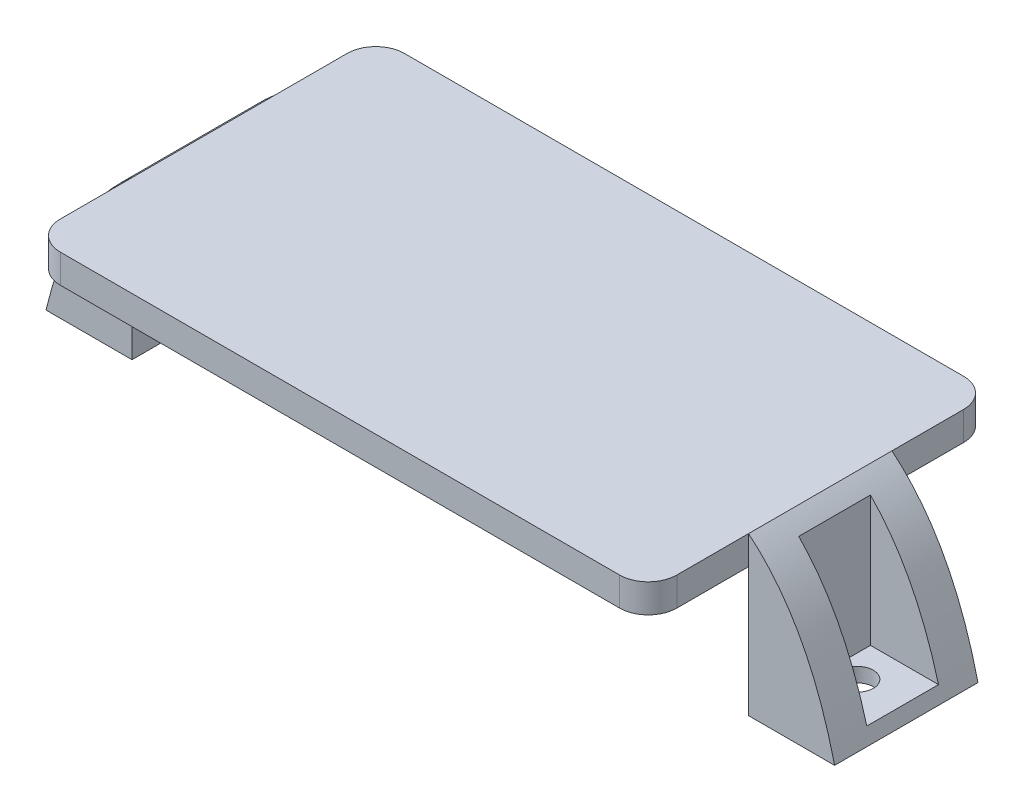
ISO-10303-21;
HEADER;
FILE_DESCRIPTION(('STEP AP214'),'2;1');
FILE_NAME('part.step','',(''),(''),'','','');
FILE_SCHEMA(('AUTOMOTIVE_DESIGN { 1 0 10303 214 1 1 1 1 }'));
ENDSEC;
DATA;
#1=APPLICATION_CONTEXT('core data for automotive mechanical design processes');
#2=APPLICATION_PROTOCOL_DEFINITION('international standard','automotive_design',2000,#1);
#3=PRODUCT_CONTEXT('',#1,'mechanical');
#4=PRODUCT('Part','Part','',(#3));
#5=PRODUCT_RELATED_PRODUCT_CATEGORY('part','',(#4));
#6=PRODUCT_DEFINITION_FORMATION('','',#4);
#7=PRODUCT_DEFINITION_CONTEXT('part definition',#1,'design');
#8=PRODUCT_DEFINITION('design','',#6,#7);
#9=PRODUCT_DEFINITION_SHAPE('','',#8);
#10=(LENGTH_UNIT() NAMED_UNIT(*) SI_UNIT(.MILLI.,.METRE.));
#11=(NAMED_UNIT(*) PLANE_ANGLE_UNIT() SI_UNIT($,.RADIAN.));
#12=(NAMED_UNIT(*) SI_UNIT($,.STERADIAN.) SOLID_ANGLE_UNIT());
#13=UNCERTAINTY_MEASURE_WITH_UNIT(LENGTH_MEASURE(1.E-05),#10,'distance_accuracy_value','');
#14=(GEOMETRIC_REPRESENTATION_CONTEXT(3) GLOBAL_UNCERTAINTY_ASSIGNED_CONTEXT((#13)) GLOBAL_UNIT_ASSIGNED_CONTEXT((#10,
#11,#12)) REPRESENTATION_CONTEXT('',''));
#15=CARTESIAN_POINT('',(0.,0.,0.));
#16=DIRECTION('',(0.,0.,1.));
#17=DIRECTION('',(1.,0.,0.));
#18=AXIS2_PLACEMENT_3D('',#15,#16,#17);
#19=CARTESIAN_POINT('',(-34.925,-13.97,-6.35));
#20=CARTESIAN_POINT('',(-28.7239984805834,11.9854693092136,-6.35));
#21=CARTESIAN_POINT('',(0.,0.,-6.35));
#22=B_SPLINE_CURVE_WITH_KNOTS('',2,(#19,#20,#21),.UNSPECIFIED.,.F.,.F.,(3,3),(0.,1.),.UNSPECIFIED.);
#23=DIRECTION('',(0.,0.,1.));
#24=VECTOR('',#23,1.);
#25=SURFACE_OF_LINEAR_EXTRUSION('',#22,#24);
#26=DIRECTION('',(0.,0.,1.));
#27=VECTOR('',#26,1.);
#28=CARTESIAN_POINT('',(-34.925,-13.97,-6.35));
#29=LINE('',#28,#27);
#30=CARTESIAN_POINT('',(-34.925,-13.97,-6.35));
#31=VERTEX_POINT('',#30);
#32=CARTESIAN_POINT('',(-34.925,-13.97,6.35));
#33=VERTEX_POINT('',#32);
#34=EDGE_CURVE('E243',#31,#33,#29,.T.);
#35=ORIENTED_EDGE('',*,*,#34,.T.);
#36=CARTESIAN_POINT('',(-34.925,-13.97,6.35));
#37=CARTESIAN_POINT('',(-28.7239984805834,11.9854693092136,6.35));
#38=CARTESIAN_POINT('',(0.,0.,6.35));
#39=B_SPLINE_CURVE_WITH_KNOTS('',2,(#36,#37,#38),.UNSPECIFIED.,.F.,.F.,(3,3),(0.,1.),.UNSPECIFIED.);
#40=CARTESIAN_POINT('',(-27.305,0.,6.35));
#41=VERTEX_POINT('',#40);
#42=EDGE_CURVE('E221',#33,#41,#39,.T.);
#43=ORIENTED_EDGE('',*,*,#42,.T.);
#44=DIRECTION('',(0.,0.,1.));
#45=VECTOR('',#44,1.);
#46=CARTESIAN_POINT('',(-27.305,0.,-6.35));
#47=LINE('',#46,#45);
#48=CARTESIAN_POINT('',(-27.305,0.,-6.34999999999999));
#49=VERTEX_POINT('',#48);
#50=EDGE_CURVE('E467',#49,#41,#47,.T.);
#51=ORIENTED_EDGE('',*,*,#50,.F.);
#52=EDGE_CURVE('E236',#31,#49,#22,.T.);
#53=ORIENTED_EDGE('',*,*,#52,.F.);
#54=EDGE_LOOP('',(#35,#43,#51,#53));
#55=FACE_BOUND('',#54,.T.);
#56=CARTESIAN_POINT('',(-34.925,-13.97,-3.175));
#57=CARTESIAN_POINT('',(-28.7239984805834,11.9854693092136,-3.175));
#58=CARTESIAN_POINT('',(0.,0.,-3.175));
#59=B_SPLINE_CURVE_WITH_KNOTS('',2,(#56,#57,#58),.UNSPECIFIED.,.F.,.F.,(3,3),(0.,1.),.UNSPECIFIED.);
#60=CARTESIAN_POINT('',(-28.575,-1.16685256923188,-3.175));
#61=VERTEX_POINT('',#60);
#62=CARTESIAN_POINT('',(-34.6019711182352,-12.7,-3.175));
#63=VERTEX_POINT('',#62);
#64=EDGE_CURVE('E11',#61,#63,#59,.F.);
#65=ORIENTED_EDGE('',*,*,#64,.F.);
#66=DIRECTION('',(0.,0.,1.));
#67=VECTOR('',#66,1.);
#68=CARTESIAN_POINT('',(-28.575,-1.16685256923188,-6.35));
#69=LINE('',#68,#67);
#70=CARTESIAN_POINT('',(-28.575,-1.16685256923593,3.175));
#71=VERTEX_POINT('',#70);
#72=EDGE_CURVE('E50',#71,#61,#69,.F.);
#73=ORIENTED_EDGE('',*,*,#72,.F.);
#74=CARTESIAN_POINT('',(-34.925,-13.97,3.175));
#75=CARTESIAN_POINT('',(-28.7239984805834,11.9854693092136,3.175));
#76=CARTESIAN_POINT('',(0.,0.,3.175));
#77=B_SPLINE_CURVE_WITH_KNOTS('',2,(#74,#75,#76),.UNSPECIFIED.,.F.,.F.,(3,3),(0.,1.),.UNSPECIFIED.);
#78=CARTESIAN_POINT('',(-34.6019711182352,-12.7,3.175));
#79=VERTEX_POINT('',#78);
#80=EDGE_CURVE('E204',#79,#71,#77,.T.);
#81=ORIENTED_EDGE('',*,*,#80,.F.);
#82=DIRECTION('',(0.,0.,1.));
#83=VECTOR('',#82,1.);
#84=CARTESIAN_POINT('',(-34.6019711182352,-12.7,-6.35));
#85=LINE('',#84,#83);
#86=EDGE_CURVE('E208',#63,#79,#85,.T.);
#87=ORIENTED_EDGE('',*,*,#86,.F.);
#88=EDGE_LOOP('',(#65,#73,#81,#87));
#89=FACE_BOUND('',#88,.T.);
#90=ADVANCED_FACE('F41',(#55,#89),#25,.F.);
#91=CARTESIAN_POINT('',(-27.305,-2.54,15.24));
#92=DIRECTION('',(-1.,0.,0.));
#93=DIRECTION('',(0.,0.,1.));
#94=AXIS2_PLACEMENT_3D('',#91,#92,#93);
#95=PLANE('',#94);
#96=DIRECTION('',(0.,0.,1.));
#97=VECTOR('',#96,1.);
#98=CARTESIAN_POINT('',(-27.305,0.,15.24));
#99=LINE('',#98,#97);
#100=CARTESIAN_POINT('',(-27.305,0.,12.7));
#101=VERTEX_POINT('',#100);
#102=EDGE_CURVE('E348',#41,#101,#99,.T.);
#103=ORIENTED_EDGE('',*,*,#102,.F.);
#104=DIRECTION('',(0.,-1.,0.));
#105=VECTOR('',#104,1.);
#106=CARTESIAN_POINT('',(-27.305,0.,6.35));
#107=LINE('',#106,#105);
#108=CARTESIAN_POINT('',(-27.305,-2.54,6.35));
#109=VERTEX_POINT('',#108);
#110=EDGE_CURVE('E64',#41,#109,#107,.T.);
#111=ORIENTED_EDGE('',*,*,#110,.T.);
#112=DIRECTION('',(0.,0.,1.));
#113=VECTOR('',#112,1.);
#114=CARTESIAN_POINT('',(-27.305,-2.54,15.24));
#115=LINE('',#114,#113);
#116=CARTESIAN_POINT('',(-27.305,-2.54,12.7));
#117=VERTEX_POINT('',#116);
#118=EDGE_CURVE('E334',#109,#117,#115,.T.);
#119=ORIENTED_EDGE('',*,*,#118,.T.);
#120=DIRECTION('',(0.,1.,0.));
#121=VECTOR('',#120,1.);
#122=CARTESIAN_POINT('',(-27.305,-2.54,12.7));
#123=LINE('',#122,#121);
#124=EDGE_CURVE('E367',#117,#101,#123,.T.);
#125=ORIENTED_EDGE('',*,*,#124,.T.);
#126=EDGE_LOOP('',(#103,#111,#119,#125));
#127=FACE_BOUND('',#126,.T.);
#128=ADVANCED_FACE('F252',(#127),#95,.T.);
#129=CARTESIAN_POINT('',(27.305,-2.54,15.24));
#130=DIRECTION('',(1.,0.,0.));
#131=DIRECTION('',(0.,0.,-1.));
#132=AXIS2_PLACEMENT_3D('',#129,#130,#131);
#133=PLANE('',#132);
#134=DIRECTION('',(0.,0.,-1.));
#135=VECTOR('',#134,1.);
#136=CARTESIAN_POINT('',(27.305,0.,15.24));
#137=LINE('',#136,#135);
#138=CARTESIAN_POINT('',(27.305,0.,-6.35));
#139=VERTEX_POINT('',#138);
#140=CARTESIAN_POINT('',(27.305,0.,-12.7));
#141=VERTEX_POINT('',#140);
#142=EDGE_CURVE('E322',#139,#141,#137,.T.);
#143=ORIENTED_EDGE('',*,*,#142,.F.);
#144=DIRECTION('',(0.,-1.,0.));
#145=VECTOR('',#144,1.);
#146=CARTESIAN_POINT('',(27.305,0.,-6.35));
#147=LINE('',#146,#145);
#148=CARTESIAN_POINT('',(27.305,-2.54,-6.34999999999999));
#149=VERTEX_POINT('',#148);
#150=EDGE_CURVE('E312',#139,#149,#147,.T.);
#151=ORIENTED_EDGE('',*,*,#150,.T.);
#152=DIRECTION('',(0.,0.,-1.));
#153=VECTOR('',#152,1.);
#154=CARTESIAN_POINT('',(27.305,-2.54,15.24));
#155=LINE('',#154,#153);
#156=CARTESIAN_POINT('',(27.305,-2.54,-12.7));
#157=VERTEX_POINT('',#156);
#158=EDGE_CURVE('E331',#149,#157,#155,.T.);
#159=ORIENTED_EDGE('',*,*,#158,.T.);
#160=DIRECTION('',(0.,1.,0.));
#161=VECTOR('',#160,1.);
#162=CARTESIAN_POINT('',(27.305,-2.54,-12.7));
#163=LINE('',#162,#161);
#164=EDGE_CURVE('E387',#157,#141,#163,.T.);
#165=ORIENTED_EDGE('',*,*,#164,.T.);
#166=EDGE_LOOP('',(#143,#151,#159,#165));
#167=FACE_BOUND('',#166,.T.);
#168=ADVANCED_FACE('F556',(#167),#133,.T.);
#169=DIRECTION('',(0.,-1.,0.));
#170=VECTOR('',#169,1.);
#171=CARTESIAN_POINT('',(27.305,0.,6.35));
#172=LINE('',#171,#170);
#173=CARTESIAN_POINT('',(27.305,0.,6.35));
#174=VERTEX_POINT('',#173);
#175=CARTESIAN_POINT('',(27.305,-2.54,6.35));
#176=VERTEX_POINT('',#175);
#177=EDGE_CURVE('E496',#174,#176,#172,.T.);
#178=ORIENTED_EDGE('',*,*,#177,.F.);
#179=CARTESIAN_POINT('',(27.305,0.,12.7));
#180=VERTEX_POINT('',#179);
#181=EDGE_CURVE('E342',#180,#174,#137,.T.);
#182=ORIENTED_EDGE('',*,*,#181,.F.);
#183=DIRECTION('',(0.,1.,0.));
#184=VECTOR('',#183,1.);
#185=CARTESIAN_POINT('',(27.305,-2.54,12.7));
#186=LINE('',#185,#184);
#187=CARTESIAN_POINT('',(27.305,-2.54,12.7));
#188=VERTEX_POINT('',#187);
#189=EDGE_CURVE('E390',#180,#188,#186,.F.);
#190=ORIENTED_EDGE('',*,*,#189,.T.);
#191=EDGE_CURVE('E326',#188,#176,#155,.T.);
#192=ORIENTED_EDGE('',*,*,#191,.T.);
#193=EDGE_LOOP('',(#178,#182,#190,#192));
#194=FACE_BOUND('',#193,.T.);
#195=ADVANCED_FACE('F515',(#194),#133,.T.);
#196=CARTESIAN_POINT('',(-27.305,-2.54,15.24));
#197=DIRECTION('',(0.,0.,1.));
#198=DIRECTION('',(1.,0.,0.));
#199=AXIS2_PLACEMENT_3D('',#196,#197,#198);
#200=PLANE('',#199);
#201=DIRECTION('',(1.,0.,0.));
#202=VECTOR('',#201,1.);
#203=CARTESIAN_POINT('',(-27.305,0.,15.24));
#204=LINE('',#203,#202);
#205=CARTESIAN_POINT('',(-24.765,0.,15.24));
#206=VERTEX_POINT('',#205);
#207=CARTESIAN_POINT('',(24.765,0.,15.24));
#208=VERTEX_POINT('',#207);
#209=EDGE_CURVE('E352',#206,#208,#204,.T.);
#210=ORIENTED_EDGE('',*,*,#209,.F.);
#211=DIRECTION('',(0.,1.,0.));
#212=VECTOR('',#211,1.);
#213=CARTESIAN_POINT('',(-24.765,-2.54,15.24));
#214=LINE('',#213,#212);
#215=CARTESIAN_POINT('',(-24.765,-2.54,15.24));
#216=VERTEX_POINT('',#215);
#217=EDGE_CURVE('E385',#206,#216,#214,.F.);
#218=ORIENTED_EDGE('',*,*,#217,.T.);
#219=DIRECTION('',(1.,0.,0.));
#220=VECTOR('',#219,1.);
#221=CARTESIAN_POINT('',(-27.305,-2.54,15.24));
#222=LINE('',#221,#220);
#223=CARTESIAN_POINT('',(24.765,-2.54,15.24));
#224=VERTEX_POINT('',#223);
#225=EDGE_CURVE('E337',#216,#224,#222,.T.);
#226=ORIENTED_EDGE('',*,*,#225,.T.);
#227=DIRECTION('',(0.,1.,0.));
#228=VECTOR('',#227,1.);
#229=CARTESIAN_POINT('',(24.765,-2.54,15.24));
#230=LINE('',#229,#228);
#231=EDGE_CURVE('E382',#224,#208,#230,.T.);
#232=ORIENTED_EDGE('',*,*,#231,.T.);
#233=EDGE_LOOP('',(#210,#218,#226,#232));
#234=FACE_BOUND('',#233,.T.);
#235=ADVANCED_FACE('F525',(#234),#200,.T.);
#236=DIRECTION('',(0.,-1.,0.));
#237=VECTOR('',#236,1.);
#238=CARTESIAN_POINT('',(-27.305,0.,-6.35));
#239=LINE('',#238,#237);
#240=CARTESIAN_POINT('',(-27.305,-2.54,-6.35));
#241=VERTEX_POINT('',#240);
#242=EDGE_CURVE('E233',#49,#241,#239,.T.);
#243=ORIENTED_EDGE('',*,*,#242,.F.);
#244=CARTESIAN_POINT('',(-27.305,0.,-12.7));
#245=VERTEX_POINT('',#244);
#246=EDGE_CURVE('E349',#245,#49,#99,.T.);
#247=ORIENTED_EDGE('',*,*,#246,.F.);
#248=DIRECTION('',(0.,1.,0.));
#249=VECTOR('',#248,1.);
#250=CARTESIAN_POINT('',(-27.305,-2.54,-12.7));
#251=LINE('',#250,#249);
#252=CARTESIAN_POINT('',(-27.305,-2.54,-12.7));
#253=VERTEX_POINT('',#252);
#254=EDGE_CURVE('E370',#245,#253,#251,.F.);
#255=ORIENTED_EDGE('',*,*,#254,.T.);
#256=EDGE_CURVE('E335',#253,#241,#115,.T.);
#257=ORIENTED_EDGE('',*,*,#256,.T.);
#258=EDGE_LOOP('',(#243,#247,#255,#257));
#259=FACE_BOUND('',#258,.T.);
#260=ADVANCED_FACE('F567',(#259),#95,.T.);
#261=CARTESIAN_POINT('',(-27.305,-2.54,-15.24));
#262=DIRECTION('',(0.,0.,-1.));
#263=DIRECTION('',(-1.,0.,0.));
#264=AXIS2_PLACEMENT_3D('',#261,#262,#263);
#265=PLANE('',#264);
#266=DIRECTION('',(-1.,0.,0.));
#267=VECTOR('',#266,1.);
#268=CARTESIAN_POINT('',(-27.305,-2.54,-15.24));
#269=LINE('',#268,#267);
#270=CARTESIAN_POINT('',(24.765,-2.54,-15.24));
#271=VERTEX_POINT('',#270);
#272=CARTESIAN_POINT('',(-24.765,-2.54,-15.24));
#273=VERTEX_POINT('',#272);
#274=EDGE_CURVE('E329',#271,#273,#269,.T.);
#275=ORIENTED_EDGE('',*,*,#274,.T.);
#276=DIRECTION('',(0.,1.,0.));
#277=VECTOR('',#276,1.);
#278=CARTESIAN_POINT('',(-24.765,-2.54,-15.24));
#279=LINE('',#278,#277);
#280=CARTESIAN_POINT('',(-24.765,0.,-15.24));
#281=VERTEX_POINT('',#280);
#282=EDGE_CURVE('E356',#273,#281,#279,.T.);
#283=ORIENTED_EDGE('',*,*,#282,.T.);
#284=DIRECTION('',(-1.,0.,0.));
#285=VECTOR('',#284,1.);
#286=CARTESIAN_POINT('',(-27.305,0.,-15.24));
#287=LINE('',#286,#285);
#288=CARTESIAN_POINT('',(24.765,0.,-15.24));
#289=VERTEX_POINT('',#288);
#290=EDGE_CURVE('E345',#289,#281,#287,.T.);
#291=ORIENTED_EDGE('',*,*,#290,.F.);
#292=DIRECTION('',(0.,1.,0.));
#293=VECTOR('',#292,1.);
#294=CARTESIAN_POINT('',(24.765,-2.54,-15.24));
#295=LINE('',#294,#293);
#296=EDGE_CURVE('E341',#289,#271,#295,.F.);
#297=ORIENTED_EDGE('',*,*,#296,.T.);
#298=EDGE_LOOP('',(#275,#283,#291,#297));
#299=FACE_BOUND('',#298,.T.);
#300=ADVANCED_FACE('F547',(#299),#265,.T.);
#301=CARTESIAN_POINT('',(0.,-2.54,0.));
#302=DIRECTION('',(0.,-1.,0.));
#303=DIRECTION('',(0.,0.,-1.));
#304=AXIS2_PLACEMENT_3D('',#301,#302,#303);
#305=PLANE('',#304);
#306=ORIENTED_EDGE('',*,*,#256,.F.);
#307=CARTESIAN_POINT('',(-24.765,-2.54,-12.7));
#308=DIRECTION('',(0.,-1.,0.));
#309=DIRECTION('',(0.,0.,-1.));
#310=AXIS2_PLACEMENT_3D('',#307,#308,#309);
#311=CIRCLE('',#310,2.54);
#312=EDGE_CURVE('E380',#253,#273,#311,.T.);
#313=ORIENTED_EDGE('',*,*,#312,.T.);
#314=ORIENTED_EDGE('',*,*,#274,.F.);
#315=CARTESIAN_POINT('',(24.765,-2.54,-12.7));
#316=DIRECTION('',(0.,-1.,0.));
#317=DIRECTION('',(0.,0.,-1.));
#318=AXIS2_PLACEMENT_3D('',#315,#316,#317);
#319=CIRCLE('',#318,2.54);
#320=EDGE_CURVE('E372',#271,#157,#319,.T.);
#321=ORIENTED_EDGE('',*,*,#320,.T.);
#322=ORIENTED_EDGE('',*,*,#158,.F.);
#323=EDGE_CURVE('E330',#176,#149,#155,.T.);
#324=ORIENTED_EDGE('',*,*,#323,.F.);
#325=ORIENTED_EDGE('',*,*,#191,.F.);
#326=CARTESIAN_POINT('',(24.765,-2.54,12.7));
#327=DIRECTION('',(0.,-1.,0.));
#328=DIRECTION('',(0.,0.,-1.));
#329=AXIS2_PLACEMENT_3D('',#326,#327,#328);
#330=CIRCLE('',#329,2.54);
#331=EDGE_CURVE('E375',#188,#224,#330,.T.);
#332=ORIENTED_EDGE('',*,*,#331,.T.);
#333=ORIENTED_EDGE('',*,*,#225,.F.);
#334=CARTESIAN_POINT('',(-24.765,-2.54,12.7));
#335=DIRECTION('',(0.,-1.,0.));
#336=DIRECTION('',(0.,0.,-1.));
#337=AXIS2_PLACEMENT_3D('',#334,#335,#336);
#338=CIRCLE('',#337,2.54);
#339=EDGE_CURVE('E377',#216,#117,#338,.T.);
#340=ORIENTED_EDGE('',*,*,#339,.T.);
#341=ORIENTED_EDGE('',*,*,#118,.F.);
#342=EDGE_CURVE('E338',#241,#109,#115,.T.);
#343=ORIENTED_EDGE('',*,*,#342,.F.);
#344=EDGE_LOOP('',(#306,#313,#314,#321,#322,#324,#325,#332,#333,#340,#341,#343));
#345=FACE_BOUND('',#344,.T.);
#346=ADVANCED_FACE('F531',(#345),#305,.T.);
#347=CARTESIAN_POINT('',(0.,0.,0.));
#348=DIRECTION('',(0.,-1.,0.));
#349=DIRECTION('',(0.,0.,-1.));
#350=AXIS2_PLACEMENT_3D('',#347,#348,#349);
#351=PLANE('',#350);
#352=ORIENTED_EDGE('',*,*,#290,.T.);
#353=CARTESIAN_POINT('',(-24.765,0.,-12.7));
#354=DIRECTION('',(0.,-1.,0.));
#355=DIRECTION('',(0.,0.,-1.));
#356=AXIS2_PLACEMENT_3D('',#353,#354,#355);
#357=CIRCLE('',#356,2.54);
#358=EDGE_CURVE('E365',#281,#245,#357,.F.);
#359=ORIENTED_EDGE('',*,*,#358,.T.);
#360=ORIENTED_EDGE('',*,*,#246,.T.);
#361=ORIENTED_EDGE('',*,*,#50,.T.);
#362=ORIENTED_EDGE('',*,*,#102,.T.);
#363=CARTESIAN_POINT('',(-24.765,0.,12.7));
#364=DIRECTION('',(0.,-1.,0.));
#365=DIRECTION('',(0.,0.,-1.));
#366=AXIS2_PLACEMENT_3D('',#363,#364,#365);
#367=CIRCLE('',#366,2.54);
#368=EDGE_CURVE('E363',#101,#206,#367,.F.);
#369=ORIENTED_EDGE('',*,*,#368,.T.);
#370=ORIENTED_EDGE('',*,*,#209,.T.);
#371=CARTESIAN_POINT('',(24.765,0.,12.7));
#372=DIRECTION('',(0.,-1.,0.));
#373=DIRECTION('',(0.,0.,-1.));
#374=AXIS2_PLACEMENT_3D('',#371,#372,#373);
#375=CIRCLE('',#374,2.54);
#376=EDGE_CURVE('E361',#208,#180,#375,.F.);
#377=ORIENTED_EDGE('',*,*,#376,.T.);
#378=ORIENTED_EDGE('',*,*,#181,.T.);
#379=DIRECTION('',(0.,0.,1.));
#380=VECTOR('',#379,1.);
#381=CARTESIAN_POINT('',(27.305,0.,-6.35));
#382=LINE('',#381,#380);
#383=EDGE_CURVE('E323',#139,#174,#382,.T.);
#384=ORIENTED_EDGE('',*,*,#383,.F.);
#385=ORIENTED_EDGE('',*,*,#142,.T.);
#386=CARTESIAN_POINT('',(24.765,0.,-12.7));
#387=DIRECTION('',(0.,-1.,0.));
#388=DIRECTION('',(0.,0.,-1.));
#389=AXIS2_PLACEMENT_3D('',#386,#387,#388);
#390=CIRCLE('',#389,2.54);
#391=EDGE_CURVE('E359',#141,#289,#390,.F.);
#392=ORIENTED_EDGE('',*,*,#391,.T.);
#393=EDGE_LOOP('',(#352,#359,#360,#361,#362,#369,#370,#377,#378,#384,#385,#392));
#394=FACE_BOUND('',#393,.T.);
#395=ADVANCED_FACE('F518',(#394),#351,.F.);
#396=CARTESIAN_POINT('',(-24.765,-2.54,-12.7));
#397=DIRECTION('',(0.,1.,0.));
#398=DIRECTION('',(0.,0.,1.));
#399=AXIS2_PLACEMENT_3D('',#396,#397,#398);
#400=CYLINDRICAL_SURFACE('',#399,2.54);
#401=ORIENTED_EDGE('',*,*,#312,.F.);
#402=ORIENTED_EDGE('',*,*,#254,.F.);
#403=ORIENTED_EDGE('',*,*,#358,.F.);
#404=ORIENTED_EDGE('',*,*,#282,.F.);
#405=EDGE_LOOP('',(#401,#402,#403,#404));
#406=FACE_BOUND('',#405,.T.);
#407=ADVANCED_FACE('F544',(#406),#400,.T.);
#408=CARTESIAN_POINT('',(-24.765,-2.54,12.7));
#409=DIRECTION('',(0.,1.,0.));
#410=DIRECTION('',(0.,0.,1.));
#411=AXIS2_PLACEMENT_3D('',#408,#409,#410);
#412=CYLINDRICAL_SURFACE('',#411,2.54);
#413=ORIENTED_EDGE('',*,*,#339,.F.);
#414=ORIENTED_EDGE('',*,*,#217,.F.);
#415=ORIENTED_EDGE('',*,*,#368,.F.);
#416=ORIENTED_EDGE('',*,*,#124,.F.);
#417=EDGE_LOOP('',(#413,#414,#415,#416));
#418=FACE_BOUND('',#417,.T.);
#419=ADVANCED_FACE('F534',(#418),#412,.T.);
#420=CARTESIAN_POINT('',(24.765,-2.54,12.7));
#421=DIRECTION('',(0.,1.,0.));
#422=DIRECTION('',(0.,0.,1.));
#423=AXIS2_PLACEMENT_3D('',#420,#421,#422);
#424=CYLINDRICAL_SURFACE('',#423,2.54);
#425=ORIENTED_EDGE('',*,*,#331,.F.);
#426=ORIENTED_EDGE('',*,*,#189,.F.);
#427=ORIENTED_EDGE('',*,*,#376,.F.);
#428=ORIENTED_EDGE('',*,*,#231,.F.);
#429=EDGE_LOOP('',(#425,#426,#427,#428));
#430=FACE_BOUND('',#429,.T.);
#431=ADVANCED_FACE('F523',(#430),#424,.T.);
#432=CARTESIAN_POINT('',(24.765,-2.54,-12.7));
#433=DIRECTION('',(0.,1.,0.));
#434=DIRECTION('',(0.,0.,1.));
#435=AXIS2_PLACEMENT_3D('',#432,#433,#434);
#436=CYLINDRICAL_SURFACE('',#435,2.54);
#437=ORIENTED_EDGE('',*,*,#320,.F.);
#438=ORIENTED_EDGE('',*,*,#296,.F.);
#439=ORIENTED_EDGE('',*,*,#391,.F.);
#440=ORIENTED_EDGE('',*,*,#164,.F.);
#441=EDGE_LOOP('',(#437,#438,#439,#440));
#442=FACE_BOUND('',#441,.T.);
#443=ADVANCED_FACE('F43',(#442),#436,.T.);
#444=CARTESIAN_POINT('',(0.,-13.97,-6.35));
#445=DIRECTION('',(0.,-1.,0.));
#446=DIRECTION('',(0.,0.,-1.));
#447=AXIS2_PLACEMENT_3D('',#444,#445,#446);
#448=PLANE('',#447);
#449=CARTESIAN_POINT('',(30.607,-13.97,0.));
#450=DIRECTION('',(0.,-1.,0.));
#451=DIRECTION('',(0.,0.,-1.));
#452=AXIS2_PLACEMENT_3D('',#449,#450,#451);
#453=CIRCLE('',#452,1.39700000000001);
#454=CARTESIAN_POINT('',(30.607,-13.97,-1.39700000000001));
#455=VERTEX_POINT('',#454);
#456=EDGE_CURVE('E416',#455,#455,#453,.T.);
#457=ORIENTED_EDGE('',*,*,#456,.F.);
#458=EDGE_LOOP('',(#457));
#459=FACE_BOUND('',#458,.T.);
#460=DIRECTION('',(0.,0.,1.));
#461=VECTOR('',#460,1.);
#462=CARTESIAN_POINT('',(34.925,-13.97,-6.35));
#463=LINE('',#462,#461);
#464=CARTESIAN_POINT('',(34.925,-13.97,-6.35));
#465=VERTEX_POINT('',#464);
#466=CARTESIAN_POINT('',(34.925,-13.97,6.35));
#467=VERTEX_POINT('',#466);
#468=EDGE_CURVE('E318',#465,#467,#463,.T.);
#469=ORIENTED_EDGE('',*,*,#468,.T.);
#470=DIRECTION('',(1.,0.,0.));
#471=VECTOR('',#470,1.);
#472=CARTESIAN_POINT('',(0.,-13.97,6.35));
#473=LINE('',#472,#471);
#474=CARTESIAN_POINT('',(27.305,-13.97,6.35));
#475=VERTEX_POINT('',#474);
#476=EDGE_CURVE('E486',#475,#467,#473,.T.);
#477=ORIENTED_EDGE('',*,*,#476,.F.);
#478=DIRECTION('',(0.,0.,1.));
#479=VECTOR('',#478,1.);
#480=CARTESIAN_POINT('',(27.305,-13.97,-6.35));
#481=LINE('',#480,#479);
#482=CARTESIAN_POINT('',(27.305,-13.97,-6.35));
#483=VERTEX_POINT('',#482);
#484=EDGE_CURVE('E319',#483,#475,#481,.T.);
#485=ORIENTED_EDGE('',*,*,#484,.F.);
#486=DIRECTION('',(1.,0.,0.));
#487=VECTOR('',#486,1.);
#488=CARTESIAN_POINT('',(0.,-13.97,-6.35));
#489=LINE('',#488,#487);
#490=EDGE_CURVE('E310',#483,#465,#489,.T.);
#491=ORIENTED_EDGE('',*,*,#490,.T.);
#492=EDGE_LOOP('',(#469,#477,#485,#491));
#493=FACE_BOUND('',#492,.T.);
#494=ADVANCED_FACE('F296',(#459,#493),#448,.T.);
#495=CARTESIAN_POINT('',(27.305,0.,-6.35));
#496=DIRECTION('',(-1.,0.,0.));
#497=DIRECTION('',(0.,0.,1.));
#498=AXIS2_PLACEMENT_3D('',#495,#496,#497);
#499=PLANE('',#498);
#500=EDGE_CURVE('E495',#176,#475,#172,.T.);
#501=ORIENTED_EDGE('',*,*,#500,.F.);
#502=ORIENTED_EDGE('',*,*,#323,.T.);
#503=EDGE_CURVE('E309',#149,#483,#147,.T.);
#504=ORIENTED_EDGE('',*,*,#503,.T.);
#505=ORIENTED_EDGE('',*,*,#484,.T.);
#506=EDGE_LOOP('',(#501,#502,#504,#505));
#507=FACE_BOUND('',#506,.T.);
#508=ADVANCED_FACE('F293',(#507),#499,.T.);
#509=CARTESIAN_POINT('',(34.925,-13.97,-6.35));
#510=CARTESIAN_POINT('',(28.7239984805834,11.9854693092136,-6.35));
#511=CARTESIAN_POINT('',(0.,0.,-6.35));
#512=B_SPLINE_CURVE_WITH_KNOTS('',2,(#509,#510,#511),.UNSPECIFIED.,.F.,.F.,(3,3),(0.,1.),.UNSPECIFIED.);
#513=DIRECTION('',(0.,0.,1.));
#514=VECTOR('',#513,1.);
#515=SURFACE_OF_LINEAR_EXTRUSION('',#512,#514);
#516=CARTESIAN_POINT('',(34.925,-13.97,3.175));
#517=CARTESIAN_POINT('',(28.7239984805834,11.9854693092136,3.175));
#518=CARTESIAN_POINT('',(0.,0.,3.175));
#519=B_SPLINE_CURVE_WITH_KNOTS('',2,(#516,#517,#518),.UNSPECIFIED.,.F.,.F.,(3,3),(0.,1.),.UNSPECIFIED.);
#520=CARTESIAN_POINT('',(28.575,-1.16685256923188,3.175));
#521=VERTEX_POINT('',#520);
#522=CARTESIAN_POINT('',(34.6019711182352,-12.7,3.175));
#523=VERTEX_POINT('',#522);
#524=EDGE_CURVE('E404',#521,#523,#519,.F.);
#525=ORIENTED_EDGE('',*,*,#524,.F.);
#526=DIRECTION('',(0.,0.,1.));
#527=VECTOR('',#526,1.);
#528=CARTESIAN_POINT('',(28.575,-1.16685256923188,-6.35));
#529=LINE('',#528,#527);
#530=CARTESIAN_POINT('',(28.575,-1.16685256923593,-3.175));
#531=VERTEX_POINT('',#530);
#532=EDGE_CURVE('E399',#531,#521,#529,.T.);
#533=ORIENTED_EDGE('',*,*,#532,.F.);
#534=CARTESIAN_POINT('',(34.925,-13.97,-3.175));
#535=CARTESIAN_POINT('',(28.7239984805834,11.9854693092136,-3.175));
#536=CARTESIAN_POINT('',(0.,0.,-3.175));
#537=B_SPLINE_CURVE_WITH_KNOTS('',2,(#534,#535,#536),.UNSPECIFIED.,.F.,.F.,(3,3),(0.,1.),.UNSPECIFIED.);
#538=CARTESIAN_POINT('',(34.6019711182352,-12.7,-3.175));
#539=VERTEX_POINT('',#538);
#540=EDGE_CURVE('E395',#539,#531,#537,.T.);
#541=ORIENTED_EDGE('',*,*,#540,.F.);
#542=DIRECTION('',(0.,0.,1.));
#543=VECTOR('',#542,1.);
#544=CARTESIAN_POINT('',(34.6019711182352,-12.7,-6.35));
#545=LINE('',#544,#543);
#546=EDGE_CURVE('E392',#539,#523,#545,.T.);
#547=ORIENTED_EDGE('',*,*,#546,.T.);
#548=EDGE_LOOP('',(#525,#533,#541,#547));
#549=FACE_BOUND('',#548,.T.);
#550=ORIENTED_EDGE('',*,*,#383,.T.);
#551=CARTESIAN_POINT('',(34.925,-13.97,6.35));
#552=CARTESIAN_POINT('',(28.7239984805834,11.9854693092136,6.35));
#553=CARTESIAN_POINT('',(0.,0.,6.35));
#554=B_SPLINE_CURVE_WITH_KNOTS('',2,(#551,#552,#553),.UNSPECIFIED.,.F.,.F.,(3,3),(0.,1.),.UNSPECIFIED.);
#555=EDGE_CURVE('E491',#467,#174,#554,.T.);
#556=ORIENTED_EDGE('',*,*,#555,.F.);
#557=ORIENTED_EDGE('',*,*,#468,.F.);
#558=EDGE_CURVE('E303',#465,#139,#512,.T.);
#559=ORIENTED_EDGE('',*,*,#558,.T.);
#560=EDGE_LOOP('',(#550,#556,#557,#559));
#561=FACE_BOUND('',#560,.T.);
#562=ADVANCED_FACE('F291',(#549,#561),#515,.T.);
#563=CARTESIAN_POINT('',(0.,0.,-6.35));
#564=DIRECTION('',(0.,0.,1.));
#565=DIRECTION('',(1.,0.,0.));
#566=AXIS2_PLACEMENT_3D('',#563,#564,#565);
#567=PLANE('',#566);
#568=ORIENTED_EDGE('',*,*,#490,.F.);
#569=ORIENTED_EDGE('',*,*,#503,.F.);
#570=ORIENTED_EDGE('',*,*,#150,.F.);
#571=ORIENTED_EDGE('',*,*,#558,.F.);
#572=EDGE_LOOP('',(#568,#569,#570,#571));
#573=FACE_BOUND('',#572,.T.);
#574=ADVANCED_FACE('F287',(#573),#567,.F.);
#575=CARTESIAN_POINT('',(0.,0.,6.35));
#576=DIRECTION('',(0.,0.,1.));
#577=DIRECTION('',(1.,0.,0.));
#578=AXIS2_PLACEMENT_3D('',#575,#576,#577);
#579=PLANE('',#578);
#580=ORIENTED_EDGE('',*,*,#476,.T.);
#581=ORIENTED_EDGE('',*,*,#555,.T.);
#582=ORIENTED_EDGE('',*,*,#177,.T.);
#583=ORIENTED_EDGE('',*,*,#500,.T.);
#584=EDGE_LOOP('',(#580,#581,#582,#583));
#585=FACE_BOUND('',#584,.T.);
#586=ADVANCED_FACE('F277',(#585),#579,.T.);
#587=CARTESIAN_POINT('',(34.925,-12.7,3.175));
#588=DIRECTION('',(0.,0.,1.));
#589=DIRECTION('',(1.,0.,0.));
#590=AXIS2_PLACEMENT_3D('',#587,#588,#589);
#591=PLANE('',#590);
#592=ORIENTED_EDGE('',*,*,#524,.T.);
#593=DIRECTION('',(1.,0.,0.));
#594=VECTOR('',#593,1.);
#595=CARTESIAN_POINT('',(34.925,-12.7,3.175));
#596=LINE('',#595,#594);
#597=CARTESIAN_POINT('',(28.575,-12.7,3.175));
#598=VERTEX_POINT('',#597);
#599=EDGE_CURVE('E480',#598,#523,#596,.T.);
#600=ORIENTED_EDGE('',*,*,#599,.F.);
#601=DIRECTION('',(0.,1.,0.));
#602=VECTOR('',#601,1.);
#603=CARTESIAN_POINT('',(28.575,-12.7,3.175));
#604=LINE('',#603,#602);
#605=EDGE_CURVE('E483',#598,#521,#604,.T.);
#606=ORIENTED_EDGE('',*,*,#605,.T.);
#607=EDGE_LOOP('',(#592,#600,#606));
#608=FACE_BOUND('',#607,.T.);
#609=ADVANCED_FACE('F273',(#608),#591,.F.);
#610=CARTESIAN_POINT('',(28.575,-12.7,3.175));
#611=DIRECTION('',(-1.,0.,0.));
#612=DIRECTION('',(0.,0.,1.));
#613=AXIS2_PLACEMENT_3D('',#610,#611,#612);
#614=PLANE('',#613);
#615=ORIENTED_EDGE('',*,*,#532,.T.);
#616=ORIENTED_EDGE('',*,*,#605,.F.);
#617=DIRECTION('',(0.,0.,1.));
#618=VECTOR('',#617,1.);
#619=CARTESIAN_POINT('',(28.575,-12.7,3.175));
#620=LINE('',#619,#618);
#621=CARTESIAN_POINT('',(28.575,-12.7,-3.175));
#622=VERTEX_POINT('',#621);
#623=EDGE_CURVE('E477',#622,#598,#620,.T.);
#624=ORIENTED_EDGE('',*,*,#623,.F.);
#625=DIRECTION('',(0.,1.,0.));
#626=VECTOR('',#625,1.);
#627=CARTESIAN_POINT('',(28.575,-12.7,-3.175));
#628=LINE('',#627,#626);
#629=EDGE_CURVE('E482',#622,#531,#628,.T.);
#630=ORIENTED_EDGE('',*,*,#629,.T.);
#631=EDGE_LOOP('',(#615,#616,#624,#630));
#632=FACE_BOUND('',#631,.T.);
#633=ADVANCED_FACE('F276',(#632),#614,.F.);
#634=CARTESIAN_POINT('',(34.925,-12.7,-3.175));
#635=DIRECTION('',(0.,0.,-1.));
#636=DIRECTION('',(-1.,0.,0.));
#637=AXIS2_PLACEMENT_3D('',#634,#635,#636);
#638=PLANE('',#637);
#639=ORIENTED_EDGE('',*,*,#540,.T.);
#640=ORIENTED_EDGE('',*,*,#629,.F.);
#641=DIRECTION('',(-1.,0.,0.));
#642=VECTOR('',#641,1.);
#643=CARTESIAN_POINT('',(34.925,-12.7,-3.175));
#644=LINE('',#643,#642);
#645=EDGE_CURVE('E415',#539,#622,#644,.T.);
#646=ORIENTED_EDGE('',*,*,#645,.F.);
#647=EDGE_LOOP('',(#639,#640,#646));
#648=FACE_BOUND('',#647,.T.);
#649=ADVANCED_FACE('F271',(#648),#638,.F.);
#650=CARTESIAN_POINT('',(0.,-12.7,0.));
#651=DIRECTION('',(0.,1.,0.));
#652=DIRECTION('',(0.,0.,1.));
#653=AXIS2_PLACEMENT_3D('',#650,#651,#652);
#654=PLANE('',#653);
#655=CARTESIAN_POINT('',(30.607,-12.7,0.));
#656=DIRECTION('',(0.,1.,0.));
#657=DIRECTION('',(0.,0.,1.));
#658=AXIS2_PLACEMENT_3D('',#655,#656,#657);
#659=CIRCLE('',#658,1.39700000000001);
#660=CARTESIAN_POINT('',(30.607,-12.7,1.39700000000001));
#661=VERTEX_POINT('',#660);
#662=EDGE_CURVE('E409',#661,#661,#659,.T.);
#663=ORIENTED_EDGE('',*,*,#662,.F.);
#664=EDGE_LOOP('',(#663));
#665=FACE_BOUND('',#664,.T.);
#666=ORIENTED_EDGE('',*,*,#645,.T.);
#667=ORIENTED_EDGE('',*,*,#623,.T.);
#668=ORIENTED_EDGE('',*,*,#599,.T.);
#669=ORIENTED_EDGE('',*,*,#546,.F.);
#670=EDGE_LOOP('',(#666,#667,#668,#669));
#671=FACE_BOUND('',#670,.T.);
#672=ADVANCED_FACE('F267',(#665,#671),#654,.T.);
#673=CARTESIAN_POINT('',(30.607,0.,0.));
#674=DIRECTION('',(0.,-1.,0.));
#675=DIRECTION('',(0.,0.,-1.));
#676=AXIS2_PLACEMENT_3D('',#673,#674,#675);
#677=CYLINDRICAL_SURFACE('',#676,1.39700000000001);
#678=ORIENTED_EDGE('',*,*,#662,.T.);
#679=EDGE_LOOP('',(#678));
#680=FACE_BOUND('',#679,.T.);
#681=ORIENTED_EDGE('',*,*,#456,.T.);
#682=EDGE_LOOP('',(#681));
#683=FACE_BOUND('',#682,.T.);
#684=ADVANCED_FACE('F260',(#680,#683),#677,.F.);
#685=CARTESIAN_POINT('',(-27.305,0.,-6.35));
#686=DIRECTION('',(-1.,0.,0.));
#687=DIRECTION('',(0.,0.,1.));
#688=AXIS2_PLACEMENT_3D('',#685,#686,#687);
#689=PLANE('',#688);
#690=CARTESIAN_POINT('',(-27.305,-13.97,-6.35));
#691=VERTEX_POINT('',#690);
#692=EDGE_CURVE('E232',#241,#691,#239,.T.);
#693=ORIENTED_EDGE('',*,*,#692,.F.);
#694=ORIENTED_EDGE('',*,*,#342,.T.);
#695=CARTESIAN_POINT('',(-27.305,-13.97,6.35));
#696=VERTEX_POINT('',#695);
#697=EDGE_CURVE('E219',#109,#696,#107,.T.);
#698=ORIENTED_EDGE('',*,*,#697,.T.);
#699=DIRECTION('',(0.,0.,1.));
#700=VECTOR('',#699,1.);
#701=CARTESIAN_POINT('',(-27.305,-13.97,-6.35));
#702=LINE('',#701,#700);
#703=EDGE_CURVE('E242',#691,#696,#702,.T.);
#704=ORIENTED_EDGE('',*,*,#703,.F.);
#705=EDGE_LOOP('',(#693,#694,#698,#704));
#706=FACE_BOUND('',#705,.T.);
#707=ADVANCED_FACE('F256',(#706),#689,.F.);
#708=CARTESIAN_POINT('',(0.,-13.97,-6.35));
#709=DIRECTION('',(0.,1.,0.));
#710=DIRECTION('',(0.,0.,1.));
#711=AXIS2_PLACEMENT_3D('',#708,#709,#710);
#712=PLANE('',#711);
#713=CARTESIAN_POINT('',(-30.607,-13.97,0.));
#714=DIRECTION('',(0.,1.,0.));
#715=DIRECTION('',(0.,0.,-1.));
#716=AXIS2_PLACEMENT_3D('',#713,#714,#715);
#717=CIRCLE('',#716,1.39700000000001);
#718=CARTESIAN_POINT('',(-30.607,-13.97,-1.39700000000001));
#719=VERTEX_POINT('',#718);
#720=EDGE_CURVE('E211',#719,#719,#717,.T.);
#721=ORIENTED_EDGE('',*,*,#720,.T.);
#722=EDGE_LOOP('',(#721));
#723=FACE_BOUND('',#722,.T.);
#724=ORIENTED_EDGE('',*,*,#703,.T.);
#725=DIRECTION('',(-1.,0.,0.));
#726=VECTOR('',#725,1.);
#727=CARTESIAN_POINT('',(0.,-13.97,6.35));
#728=LINE('',#727,#726);
#729=EDGE_CURVE('E215',#696,#33,#728,.T.);
#730=ORIENTED_EDGE('',*,*,#729,.T.);
#731=ORIENTED_EDGE('',*,*,#34,.F.);
#732=DIRECTION('',(-1.,0.,0.));
#733=VECTOR('',#732,1.);
#734=CARTESIAN_POINT('',(0.,-13.97,-6.35));
#735=LINE('',#734,#733);
#736=EDGE_CURVE('E226',#691,#31,#735,.T.);
#737=ORIENTED_EDGE('',*,*,#736,.F.);
#738=EDGE_LOOP('',(#724,#730,#731,#737));
#739=FACE_BOUND('',#738,.T.);
#740=ADVANCED_FACE('F259',(#723,#739),#712,.F.);
#741=CARTESIAN_POINT('',(0.,0.,-6.35));
#742=DIRECTION('',(0.,0.,1.));
#743=DIRECTION('',(-1.,0.,0.));
#744=AXIS2_PLACEMENT_3D('',#741,#742,#743);
#745=PLANE('',#744);
#746=ORIENTED_EDGE('',*,*,#736,.T.);
#747=ORIENTED_EDGE('',*,*,#52,.T.);
#748=ORIENTED_EDGE('',*,*,#242,.T.);
#749=ORIENTED_EDGE('',*,*,#692,.T.);
#750=EDGE_LOOP('',(#746,#747,#748,#749));
#751=FACE_BOUND('',#750,.T.);
#752=ADVANCED_FACE('F254',(#751),#745,.F.);
#753=CARTESIAN_POINT('',(0.,0.,6.35));
#754=DIRECTION('',(0.,0.,1.));
#755=DIRECTION('',(-1.,0.,0.));
#756=AXIS2_PLACEMENT_3D('',#753,#754,#755);
#757=PLANE('',#756);
#758=ORIENTED_EDGE('',*,*,#729,.F.);
#759=ORIENTED_EDGE('',*,*,#697,.F.);
#760=ORIENTED_EDGE('',*,*,#110,.F.);
#761=ORIENTED_EDGE('',*,*,#42,.F.);
#762=EDGE_LOOP('',(#758,#759,#760,#761));
#763=FACE_BOUND('',#762,.T.);
#764=ADVANCED_FACE('F434',(#763),#757,.T.);
#765=CARTESIAN_POINT('',(-34.925,-12.7,-3.175));
#766=DIRECTION('',(0.,0.,1.));
#767=DIRECTION('',(1.,0.,0.));
#768=AXIS2_PLACEMENT_3D('',#765,#766,#767);
#769=PLANE('',#768);
#770=ORIENTED_EDGE('',*,*,#64,.T.);
#771=DIRECTION('',(1.,0.,0.));
#772=VECTOR('',#771,1.);
#773=CARTESIAN_POINT('',(-34.925,-12.7,-3.175));
#774=LINE('',#773,#772);
#775=CARTESIAN_POINT('',(-28.575,-12.7,-3.175));
#776=VERTEX_POINT('',#775);
#777=EDGE_CURVE('E57',#63,#776,#774,.T.);
#778=ORIENTED_EDGE('',*,*,#777,.T.);
#779=DIRECTION('',(0.,1.,0.));
#780=VECTOR('',#779,1.);
#781=CARTESIAN_POINT('',(-28.575,-12.7,-3.175));
#782=LINE('',#781,#780);
#783=EDGE_CURVE('E196',#776,#61,#782,.T.);
#784=ORIENTED_EDGE('',*,*,#783,.T.);
#785=EDGE_LOOP('',(#770,#778,#784));
#786=FACE_BOUND('',#785,.T.);
#787=ADVANCED_FACE('F432',(#786),#769,.T.);
#788=CARTESIAN_POINT('',(-28.575,-12.7,3.175));
#789=DIRECTION('',(-1.,0.,0.));
#790=DIRECTION('',(0.,0.,1.));
#791=AXIS2_PLACEMENT_3D('',#788,#789,#790);
#792=PLANE('',#791);
#793=ORIENTED_EDGE('',*,*,#72,.T.);
#794=ORIENTED_EDGE('',*,*,#783,.F.);
#795=DIRECTION('',(0.,0.,1.));
#796=VECTOR('',#795,1.);
#797=CARTESIAN_POINT('',(-28.575,-12.7,3.175));
#798=LINE('',#797,#796);
#799=CARTESIAN_POINT('',(-28.575,-12.7,3.175));
#800=VERTEX_POINT('',#799);
#801=EDGE_CURVE('E190',#776,#800,#798,.T.);
#802=ORIENTED_EDGE('',*,*,#801,.T.);
#803=DIRECTION('',(0.,1.,0.));
#804=VECTOR('',#803,1.);
#805=CARTESIAN_POINT('',(-28.575,-12.7,3.175));
#806=LINE('',#805,#804);
#807=EDGE_CURVE('E193',#800,#71,#806,.T.);
#808=ORIENTED_EDGE('',*,*,#807,.T.);
#809=EDGE_LOOP('',(#793,#794,#802,#808));
#810=FACE_BOUND('',#809,.T.);
#811=ADVANCED_FACE('F192',(#810),#792,.T.);
#812=CARTESIAN_POINT('',(-34.925,-12.7,3.175));
#813=DIRECTION('',(0.,0.,-1.));
#814=DIRECTION('',(-1.,0.,0.));
#815=AXIS2_PLACEMENT_3D('',#812,#813,#814);
#816=PLANE('',#815);
#817=ORIENTED_EDGE('',*,*,#80,.T.);
#818=ORIENTED_EDGE('',*,*,#807,.F.);
#819=DIRECTION('',(-1.,0.,0.));
#820=VECTOR('',#819,1.);
#821=CARTESIAN_POINT('',(-34.925,-12.7,3.175));
#822=LINE('',#821,#820);
#823=EDGE_CURVE('E198',#800,#79,#822,.T.);
#824=ORIENTED_EDGE('',*,*,#823,.T.);
#825=EDGE_LOOP('',(#817,#818,#824));
#826=FACE_BOUND('',#825,.T.);
#827=ADVANCED_FACE('F202',(#826),#816,.T.);
#828=CARTESIAN_POINT('',(0.,-12.7,0.));
#829=DIRECTION('',(0.,1.,0.));
#830=DIRECTION('',(0.,0.,1.));
#831=AXIS2_PLACEMENT_3D('',#828,#829,#830);
#832=PLANE('',#831);
#833=CARTESIAN_POINT('',(-30.607,-12.7,0.));
#834=DIRECTION('',(0.,1.,0.));
#835=DIRECTION('',(0.,0.,1.));
#836=AXIS2_PLACEMENT_3D('',#833,#834,#835);
#837=CIRCLE('',#836,1.39700000000001);
#838=CARTESIAN_POINT('',(-30.607,-12.7,1.39700000000001));
#839=VERTEX_POINT('',#838);
#840=EDGE_CURVE('E45',#839,#839,#837,.F.);
#841=ORIENTED_EDGE('',*,*,#840,.T.);
#842=EDGE_LOOP('',(#841));
#843=FACE_BOUND('',#842,.T.);
#844=ORIENTED_EDGE('',*,*,#86,.T.);
#845=ORIENTED_EDGE('',*,*,#823,.F.);
#846=ORIENTED_EDGE('',*,*,#801,.F.);
#847=ORIENTED_EDGE('',*,*,#777,.F.);
#848=EDGE_LOOP('',(#844,#845,#846,#847));
#849=FACE_BOUND('',#848,.T.);
#850=ADVANCED_FACE('F206',(#843,#849),#832,.T.);
#851=CARTESIAN_POINT('',(-30.607,0.,0.));
#852=DIRECTION('',(0.,-1.,0.));
#853=DIRECTION('',(0.,0.,-1.));
#854=AXIS2_PLACEMENT_3D('',#851,#852,#853);
#855=CYLINDRICAL_SURFACE('',#854,1.39700000000001);
#856=ORIENTED_EDGE('',*,*,#840,.F.);
#857=EDGE_LOOP('',(#856));
#858=FACE_BOUND('',#857,.T.);
#859=ORIENTED_EDGE('',*,*,#720,.F.);
#860=EDGE_LOOP('',(#859));
#861=FACE_BOUND('',#860,.T.);
#862=ADVANCED_FACE('F449',(#858,#861),#855,.F.);
#863=CLOSED_SHELL('',(#90,#128,#168,#195,#235,#260,#300,#346,#395,#407,#419,#431,#443,#494,#508,
#562,#574,#586,#609,#633,#649,#672,#684,#707,#740,#752,#764,#787,#811,#827,#850,#862));
#864=MANIFOLD_SOLID_BREP('B2',#863);
#865=ADVANCED_BREP_SHAPE_REPRESENTATION('',(#18,#864),#14);
#866=SHAPE_DEFINITION_REPRESENTATION(#9,#865);
ENDSEC;
END-ISO-10303-21;
